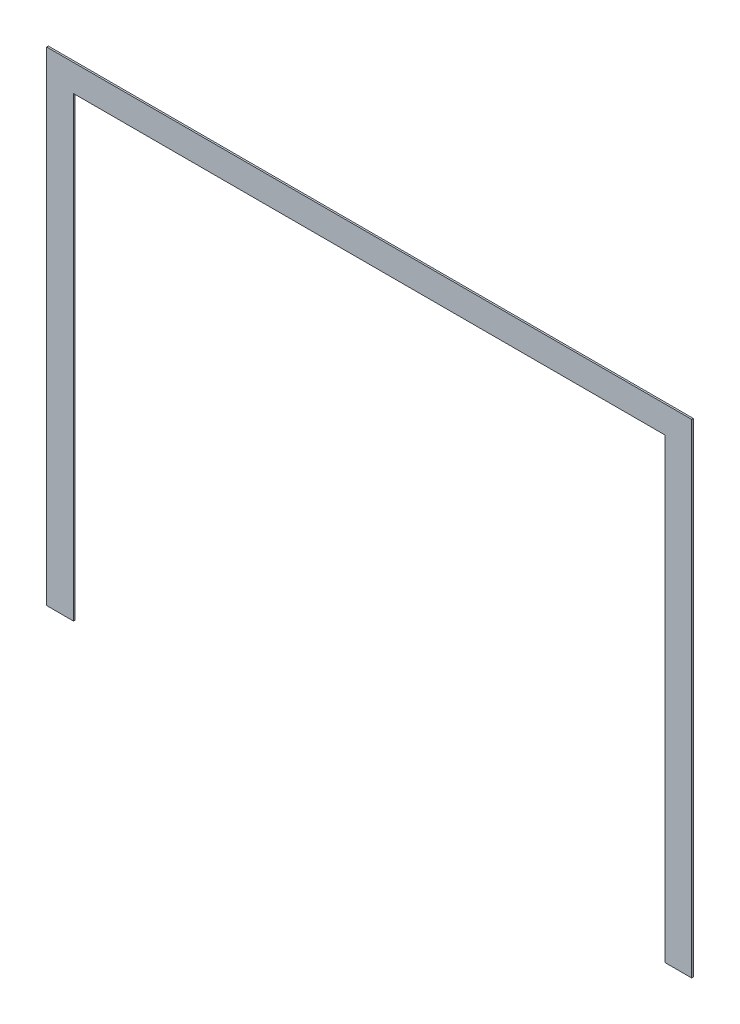
ISO-10303-21;
HEADER;
FILE_DESCRIPTION(('STEP AP214'),'2;1');
FILE_NAME('part.step','',(''),(''),'','','');
FILE_SCHEMA(('AUTOMOTIVE_DESIGN { 1 0 10303 214 1 1 1 1 }'));
ENDSEC;
DATA;
#1=APPLICATION_CONTEXT('core data for automotive mechanical design processes');
#2=APPLICATION_PROTOCOL_DEFINITION('international standard','automotive_design',2000,#1);
#3=PRODUCT_CONTEXT('',#1,'mechanical');
#4=PRODUCT('Part','Part','',(#3));
#5=PRODUCT_RELATED_PRODUCT_CATEGORY('part','',(#4));
#6=PRODUCT_DEFINITION_FORMATION('','',#4);
#7=PRODUCT_DEFINITION_CONTEXT('part definition',#1,'design');
#8=PRODUCT_DEFINITION('design','',#6,#7);
#9=PRODUCT_DEFINITION_SHAPE('','',#8);
#10=(LENGTH_UNIT() NAMED_UNIT(*) SI_UNIT(.MILLI.,.METRE.));
#11=(NAMED_UNIT(*) PLANE_ANGLE_UNIT() SI_UNIT($,.RADIAN.));
#12=(NAMED_UNIT(*) SI_UNIT($,.STERADIAN.) SOLID_ANGLE_UNIT());
#13=UNCERTAINTY_MEASURE_WITH_UNIT(LENGTH_MEASURE(1.E-05),#10,'distance_accuracy_value','');
#14=(GEOMETRIC_REPRESENTATION_CONTEXT(3) GLOBAL_UNCERTAINTY_ASSIGNED_CONTEXT((#13)) GLOBAL_UNIT_ASSIGNED_CONTEXT((#10,
#11,#12)) REPRESENTATION_CONTEXT('',''));
#15=CARTESIAN_POINT('',(0.,0.,0.));
#16=DIRECTION('',(0.,0.,1.));
#17=DIRECTION('',(1.,0.,0.));
#18=AXIS2_PLACEMENT_3D('',#15,#16,#17);
#19=CARTESIAN_POINT('',(-4203.86075973511,-2342.79235343933,0.));
#20=DIRECTION('',(0.,0.,1.));
#21=DIRECTION('',(1.,0.,0.));
#22=AXIS2_PLACEMENT_3D('',#19,#20,#21);
#23=PLANE('',#22);
#24=DIRECTION('',(1.,0.,0.));
#25=VECTOR('',#24,1.);
#26=CARTESIAN_POINT('',(-4203.86075973511,-1885.59235343933,0.));
#27=LINE('',#26,#25);
#28=CARTESIAN_POINT('',(-3594.26075973511,-1885.59235343933,0.));
#29=VERTEX_POINT('',#28);
#30=CARTESIAN_POINT('',(-4813.46075973511,-1885.59235343933,0.));
#31=VERTEX_POINT('',#30);
#32=EDGE_CURVE('E124',#29,#31,#27,.F.);
#33=ORIENTED_EDGE('',*,*,#32,.F.);
#34=DIRECTION('',(0.,1.,0.));
#35=VECTOR('',#34,1.);
#36=CARTESIAN_POINT('',(-3594.26075973511,-2342.79235343933,0.));
#37=LINE('',#36,#35);
#38=CARTESIAN_POINT('',(-3594.26075973511,-2799.99235343933,0.));
#39=VERTEX_POINT('',#38);
#40=EDGE_CURVE('E119',#39,#29,#37,.T.);
#41=ORIENTED_EDGE('',*,*,#40,.F.);
#42=DIRECTION('',(1.,0.,0.));
#43=VECTOR('',#42,1.);
#44=CARTESIAN_POINT('',(-3619.66075973511,-2799.99235343933,0.));
#45=LINE('',#44,#43);
#46=CARTESIAN_POINT('',(-3645.06075973511,-2799.99235343933,0.));
#47=VERTEX_POINT('',#46);
#48=EDGE_CURVE('E113',#47,#39,#45,.T.);
#49=ORIENTED_EDGE('',*,*,#48,.F.);
#50=DIRECTION('',(0.,1.,0.));
#51=VECTOR('',#50,1.);
#52=CARTESIAN_POINT('',(-3645.06075973511,-2368.19235343933,0.));
#53=LINE('',#52,#51);
#54=CARTESIAN_POINT('',(-3645.06075973511,-1936.39235343933,0.));
#55=VERTEX_POINT('',#54);
#56=EDGE_CURVE('E107',#55,#47,#53,.F.);
#57=ORIENTED_EDGE('',*,*,#56,.F.);
#58=DIRECTION('',(1.,0.,0.));
#59=VECTOR('',#58,1.);
#60=CARTESIAN_POINT('',(-4203.86075973511,-1936.39235343933,0.));
#61=LINE('',#60,#59);
#62=CARTESIAN_POINT('',(-4762.66075973511,-1936.39235343933,0.));
#63=VERTEX_POINT('',#62);
#64=EDGE_CURVE('E101',#63,#55,#61,.T.);
#65=ORIENTED_EDGE('',*,*,#64,.F.);
#66=DIRECTION('',(0.,1.,0.));
#67=VECTOR('',#66,1.);
#68=CARTESIAN_POINT('',(-4762.66075973511,-2368.19235343933,0.));
#69=LINE('',#68,#67);
#70=CARTESIAN_POINT('',(-4762.66075973511,-2799.99235343933,0.));
#71=VERTEX_POINT('',#70);
#72=EDGE_CURVE('E77',#71,#63,#69,.T.);
#73=ORIENTED_EDGE('',*,*,#72,.F.);
#74=DIRECTION('',(1.,0.,0.));
#75=VECTOR('',#74,1.);
#76=CARTESIAN_POINT('',(-4788.06075973511,-2799.99235343933,0.));
#77=LINE('',#76,#75);
#78=CARTESIAN_POINT('',(-4813.46075973511,-2799.99235343933,0.));
#79=VERTEX_POINT('',#78);
#80=EDGE_CURVE('E79',#79,#71,#77,.T.);
#81=ORIENTED_EDGE('',*,*,#80,.F.);
#82=DIRECTION('',(0.,1.,0.));
#83=VECTOR('',#82,1.);
#84=CARTESIAN_POINT('',(-4813.46075973511,-2342.79235343933,0.));
#85=LINE('',#84,#83);
#86=EDGE_CURVE('E17',#31,#79,#85,.F.);
#87=ORIENTED_EDGE('',*,*,#86,.F.);
#88=EDGE_LOOP('',(#33,#41,#49,#57,#65,#73,#81,#87));
#89=FACE_BOUND('',#88,.T.);
#90=ADVANCED_FACE('F14',(#89),#23,.F.);
#91=CARTESIAN_POINT('',(-4813.46075973511,-2342.79235343933,3.175));
#92=DIRECTION('',(-1.,0.,0.));
#93=DIRECTION('',(0.,0.,1.));
#94=AXIS2_PLACEMENT_3D('',#91,#92,#93);
#95=PLANE('',#94);
#96=DIRECTION('',(0.,1.,0.));
#97=VECTOR('',#96,1.);
#98=CARTESIAN_POINT('',(-4813.46075973511,-2342.79235343933,3.175));
#99=LINE('',#98,#97);
#100=CARTESIAN_POINT('',(-4813.46075973511,-1885.59235343933,3.175));
#101=VERTEX_POINT('',#100);
#102=CARTESIAN_POINT('',(-4813.46075973511,-2799.99235343933,3.175));
#103=VERTEX_POINT('',#102);
#104=EDGE_CURVE('E128',#101,#103,#99,.F.);
#105=ORIENTED_EDGE('',*,*,#104,.F.);
#106=DIRECTION('',(0.,0.,1.));
#107=VECTOR('',#106,1.);
#108=CARTESIAN_POINT('',(-4813.46075973511,-1885.59235343933,3.175));
#109=LINE('',#108,#107);
#110=EDGE_CURVE('E90',#31,#101,#109,.T.);
#111=ORIENTED_EDGE('',*,*,#110,.F.);
#112=ORIENTED_EDGE('',*,*,#86,.T.);
#113=DIRECTION('',(0.,0.,-1.));
#114=VECTOR('',#113,1.);
#115=CARTESIAN_POINT('',(-4813.46075973511,-2799.99235343933,3.175));
#116=LINE('',#115,#114);
#117=EDGE_CURVE('E85',#103,#79,#116,.T.);
#118=ORIENTED_EDGE('',*,*,#117,.F.);
#119=EDGE_LOOP('',(#105,#111,#112,#118));
#120=FACE_BOUND('',#119,.T.);
#121=ADVANCED_FACE('F87',(#120),#95,.T.);
#122=CARTESIAN_POINT('',(-4788.06075973511,-2799.99235343933,3.175));
#123=DIRECTION('',(0.,-1.,0.));
#124=DIRECTION('',(0.,0.,-1.));
#125=AXIS2_PLACEMENT_3D('',#122,#123,#124);
#126=PLANE('',#125);
#127=DIRECTION('',(1.,0.,0.));
#128=VECTOR('',#127,1.);
#129=CARTESIAN_POINT('',(-4203.86075973511,-2799.99235343933,3.175));
#130=LINE('',#129,#128);
#131=CARTESIAN_POINT('',(-4762.66075973511,-2799.99235343933,3.175));
#132=VERTEX_POINT('',#131);
#133=EDGE_CURVE('E94',#103,#132,#130,.T.);
#134=ORIENTED_EDGE('',*,*,#133,.F.);
#135=ORIENTED_EDGE('',*,*,#117,.T.);
#136=ORIENTED_EDGE('',*,*,#80,.T.);
#137=DIRECTION('',(0.,0.,-1.));
#138=VECTOR('',#137,1.);
#139=CARTESIAN_POINT('',(-4762.66075973511,-2799.99235343933,3.175));
#140=LINE('',#139,#138);
#141=EDGE_CURVE('E97',#132,#71,#140,.T.);
#142=ORIENTED_EDGE('',*,*,#141,.F.);
#143=EDGE_LOOP('',(#134,#135,#136,#142));
#144=FACE_BOUND('',#143,.T.);
#145=ADVANCED_FACE('F92',(#144),#126,.T.);
#146=CARTESIAN_POINT('',(-4762.66075973511,-2368.19235343933,3.175));
#147=DIRECTION('',(1.,0.,0.));
#148=DIRECTION('',(0.,0.,-1.));
#149=AXIS2_PLACEMENT_3D('',#146,#147,#148);
#150=PLANE('',#149);
#151=DIRECTION('',(0.,1.,0.));
#152=VECTOR('',#151,1.);
#153=CARTESIAN_POINT('',(-4762.66075973511,-2342.79235343933,3.175));
#154=LINE('',#153,#152);
#155=CARTESIAN_POINT('',(-4762.66075973511,-1936.39235343933,3.175));
#156=VERTEX_POINT('',#155);
#157=EDGE_CURVE('E131',#132,#156,#154,.T.);
#158=ORIENTED_EDGE('',*,*,#157,.F.);
#159=ORIENTED_EDGE('',*,*,#141,.T.);
#160=ORIENTED_EDGE('',*,*,#72,.T.);
#161=DIRECTION('',(0.,0.,-1.));
#162=VECTOR('',#161,1.);
#163=CARTESIAN_POINT('',(-4762.66075973511,-1936.39235343933,3.175));
#164=LINE('',#163,#162);
#165=EDGE_CURVE('E104',#156,#63,#164,.T.);
#166=ORIENTED_EDGE('',*,*,#165,.F.);
#167=EDGE_LOOP('',(#158,#159,#160,#166));
#168=FACE_BOUND('',#167,.T.);
#169=ADVANCED_FACE('F158',(#168),#150,.T.);
#170=CARTESIAN_POINT('',(-4203.86075973511,-1936.39235343933,3.175));
#171=DIRECTION('',(0.,-1.,0.));
#172=DIRECTION('',(0.,0.,-1.));
#173=AXIS2_PLACEMENT_3D('',#170,#171,#172);
#174=PLANE('',#173);
#175=DIRECTION('',(1.,0.,0.));
#176=VECTOR('',#175,1.);
#177=CARTESIAN_POINT('',(-4203.86075973511,-1936.39235343933,3.175));
#178=LINE('',#177,#176);
#179=CARTESIAN_POINT('',(-3645.06075973511,-1936.39235343933,3.175));
#180=VERTEX_POINT('',#179);
#181=EDGE_CURVE('E134',#156,#180,#178,.T.);
#182=ORIENTED_EDGE('',*,*,#181,.F.);
#183=ORIENTED_EDGE('',*,*,#165,.T.);
#184=ORIENTED_EDGE('',*,*,#64,.T.);
#185=DIRECTION('',(0.,0.,1.));
#186=VECTOR('',#185,1.);
#187=CARTESIAN_POINT('',(-3645.06075973511,-1936.39235343933,3.175));
#188=LINE('',#187,#186);
#189=EDGE_CURVE('E110',#180,#55,#188,.F.);
#190=ORIENTED_EDGE('',*,*,#189,.F.);
#191=EDGE_LOOP('',(#182,#183,#184,#190));
#192=FACE_BOUND('',#191,.T.);
#193=ADVANCED_FACE('F155',(#192),#174,.T.);
#194=CARTESIAN_POINT('',(-3645.06075973511,-2368.19235343933,3.175));
#195=DIRECTION('',(-1.,0.,0.));
#196=DIRECTION('',(0.,0.,1.));
#197=AXIS2_PLACEMENT_3D('',#194,#195,#196);
#198=PLANE('',#197);
#199=DIRECTION('',(0.,1.,0.));
#200=VECTOR('',#199,1.);
#201=CARTESIAN_POINT('',(-3645.06075973511,-2342.79235343933,3.175));
#202=LINE('',#201,#200);
#203=CARTESIAN_POINT('',(-3645.06075973511,-2799.99235343933,3.175));
#204=VERTEX_POINT('',#203);
#205=EDGE_CURVE('E137',#180,#204,#202,.F.);
#206=ORIENTED_EDGE('',*,*,#205,.F.);
#207=ORIENTED_EDGE('',*,*,#189,.T.);
#208=ORIENTED_EDGE('',*,*,#56,.T.);
#209=DIRECTION('',(0.,0.,-1.));
#210=VECTOR('',#209,1.);
#211=CARTESIAN_POINT('',(-3645.06075973511,-2799.99235343933,3.175));
#212=LINE('',#211,#210);
#213=EDGE_CURVE('E116',#204,#47,#212,.T.);
#214=ORIENTED_EDGE('',*,*,#213,.F.);
#215=EDGE_LOOP('',(#206,#207,#208,#214));
#216=FACE_BOUND('',#215,.T.);
#217=ADVANCED_FACE('F152',(#216),#198,.T.);
#218=CARTESIAN_POINT('',(-3619.66075973511,-2799.99235343933,3.175));
#219=DIRECTION('',(0.,-1.,0.));
#220=DIRECTION('',(0.,0.,-1.));
#221=AXIS2_PLACEMENT_3D('',#218,#219,#220);
#222=PLANE('',#221);
#223=DIRECTION('',(1.,0.,0.));
#224=VECTOR('',#223,1.);
#225=CARTESIAN_POINT('',(-4203.86075973511,-2799.99235343933,3.175));
#226=LINE('',#225,#224);
#227=CARTESIAN_POINT('',(-3594.26075973511,-2799.99235343933,3.175));
#228=VERTEX_POINT('',#227);
#229=EDGE_CURVE('E140',#204,#228,#226,.T.);
#230=ORIENTED_EDGE('',*,*,#229,.F.);
#231=ORIENTED_EDGE('',*,*,#213,.T.);
#232=ORIENTED_EDGE('',*,*,#48,.T.);
#233=DIRECTION('',(0.,0.,-1.));
#234=VECTOR('',#233,1.);
#235=CARTESIAN_POINT('',(-3594.26075973511,-2799.99235343933,3.175));
#236=LINE('',#235,#234);
#237=EDGE_CURVE('E121',#228,#39,#236,.T.);
#238=ORIENTED_EDGE('',*,*,#237,.F.);
#239=EDGE_LOOP('',(#230,#231,#232,#238));
#240=FACE_BOUND('',#239,.T.);
#241=ADVANCED_FACE('F149',(#240),#222,.T.);
#242=CARTESIAN_POINT('',(-3594.26075973511,-2342.79235343933,3.175));
#243=DIRECTION('',(1.,0.,0.));
#244=DIRECTION('',(0.,0.,-1.));
#245=AXIS2_PLACEMENT_3D('',#242,#243,#244);
#246=PLANE('',#245);
#247=DIRECTION('',(0.,1.,0.));
#248=VECTOR('',#247,1.);
#249=CARTESIAN_POINT('',(-3594.26075973511,-2342.79235343933,3.175));
#250=LINE('',#249,#248);
#251=CARTESIAN_POINT('',(-3594.26075973511,-1885.59235343933,3.175));
#252=VERTEX_POINT('',#251);
#253=EDGE_CURVE('E23',#228,#252,#250,.T.);
#254=ORIENTED_EDGE('',*,*,#253,.F.);
#255=ORIENTED_EDGE('',*,*,#237,.T.);
#256=ORIENTED_EDGE('',*,*,#40,.T.);
#257=DIRECTION('',(0.,0.,1.));
#258=VECTOR('',#257,1.);
#259=CARTESIAN_POINT('',(-3594.26075973511,-1885.59235343933,3.175));
#260=LINE('',#259,#258);
#261=EDGE_CURVE('E32',#252,#29,#260,.F.);
#262=ORIENTED_EDGE('',*,*,#261,.F.);
#263=EDGE_LOOP('',(#254,#255,#256,#262));
#264=FACE_BOUND('',#263,.T.);
#265=ADVANCED_FACE('F147',(#264),#246,.T.);
#266=CARTESIAN_POINT('',(-4203.86075973511,-1885.59235343933,3.175));
#267=DIRECTION('',(0.,1.,0.));
#268=DIRECTION('',(0.,0.,1.));
#269=AXIS2_PLACEMENT_3D('',#266,#267,#268);
#270=PLANE('',#269);
#271=DIRECTION('',(1.,0.,0.));
#272=VECTOR('',#271,1.);
#273=CARTESIAN_POINT('',(-4203.86075973511,-1885.59235343933,3.175));
#274=LINE('',#273,#272);
#275=EDGE_CURVE('E9',#252,#101,#274,.F.);
#276=ORIENTED_EDGE('',*,*,#275,.F.);
#277=ORIENTED_EDGE('',*,*,#261,.T.);
#278=ORIENTED_EDGE('',*,*,#32,.T.);
#279=ORIENTED_EDGE('',*,*,#110,.T.);
#280=EDGE_LOOP('',(#276,#277,#278,#279));
#281=FACE_BOUND('',#280,.T.);
#282=ADVANCED_FACE('F160',(#281),#270,.T.);
#283=CARTESIAN_POINT('',(-4203.86075973511,-2342.79235343933,3.175));
#284=DIRECTION('',(0.,0.,1.));
#285=DIRECTION('',(1.,0.,0.));
#286=AXIS2_PLACEMENT_3D('',#283,#284,#285);
#287=PLANE('',#286);
#288=ORIENTED_EDGE('',*,*,#253,.T.);
#289=ORIENTED_EDGE('',*,*,#275,.T.);
#290=ORIENTED_EDGE('',*,*,#104,.T.);
#291=ORIENTED_EDGE('',*,*,#133,.T.);
#292=ORIENTED_EDGE('',*,*,#157,.T.);
#293=ORIENTED_EDGE('',*,*,#181,.T.);
#294=ORIENTED_EDGE('',*,*,#205,.T.);
#295=ORIENTED_EDGE('',*,*,#229,.T.);
#296=EDGE_LOOP('',(#288,#289,#290,#291,#292,#293,#294,#295));
#297=FACE_BOUND('',#296,.T.);
#298=ADVANCED_FACE('F145',(#297),#287,.T.);
#299=CLOSED_SHELL('',(#90,#121,#145,#169,#193,#217,#241,#265,#282,#298));
#300=MANIFOLD_SOLID_BREP('B1',#299);
#301=ADVANCED_BREP_SHAPE_REPRESENTATION('',(#18,#300),#14);
#302=SHAPE_DEFINITION_REPRESENTATION(#9,#301);
ENDSEC;
END-ISO-10303-21;
